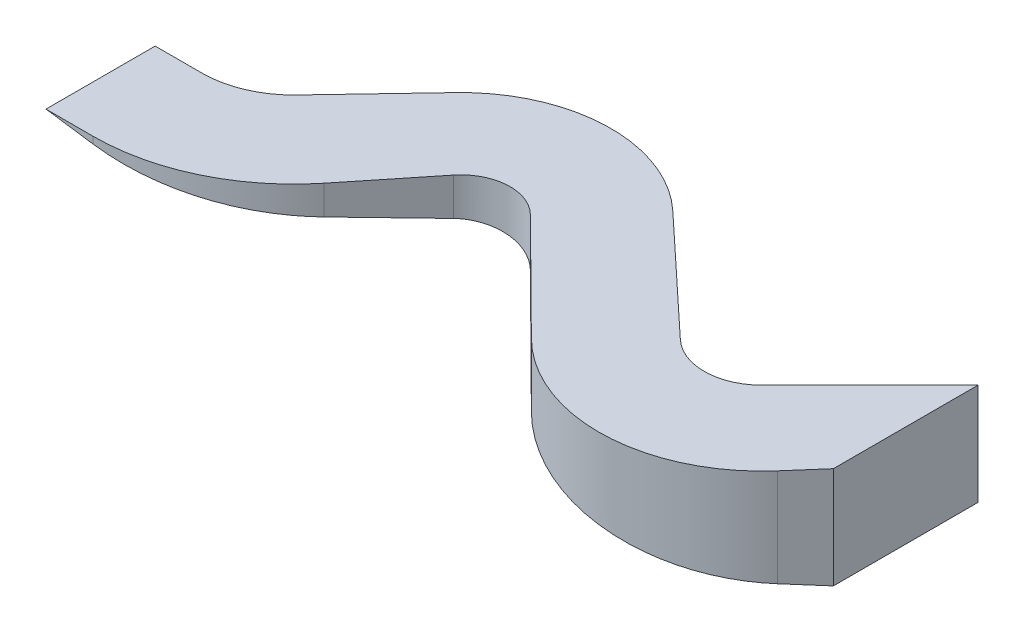
ISO-10303-21;
HEADER;
FILE_DESCRIPTION(('STEP AP214'),'2;1');
FILE_NAME('part.step','',(''),(''),'','','');
FILE_SCHEMA(('AUTOMOTIVE_DESIGN { 1 0 10303 214 1 1 1 1 }'));
ENDSEC;
DATA;
#1=APPLICATION_CONTEXT('core data for automotive mechanical design processes');
#2=APPLICATION_PROTOCOL_DEFINITION('international standard','automotive_design',2000,#1);
#3=PRODUCT_CONTEXT('',#1,'mechanical');
#4=PRODUCT('Part','Part','',(#3));
#5=PRODUCT_RELATED_PRODUCT_CATEGORY('part','',(#4));
#6=PRODUCT_DEFINITION_FORMATION('','',#4);
#7=PRODUCT_DEFINITION_CONTEXT('part definition',#1,'design');
#8=PRODUCT_DEFINITION('design','',#6,#7);
#9=PRODUCT_DEFINITION_SHAPE('','',#8);
#10=(LENGTH_UNIT() NAMED_UNIT(*) SI_UNIT(.MILLI.,.METRE.));
#11=(NAMED_UNIT(*) PLANE_ANGLE_UNIT() SI_UNIT($,.RADIAN.));
#12=(NAMED_UNIT(*) SI_UNIT($,.STERADIAN.) SOLID_ANGLE_UNIT());
#13=UNCERTAINTY_MEASURE_WITH_UNIT(LENGTH_MEASURE(1.E-05),#10,'distance_accuracy_value','');
#14=(GEOMETRIC_REPRESENTATION_CONTEXT(3) GLOBAL_UNCERTAINTY_ASSIGNED_CONTEXT((#13)) GLOBAL_UNIT_ASSIGNED_CONTEXT((#10,
#11,#12)) REPRESENTATION_CONTEXT('',''));
#15=CARTESIAN_POINT('',(0.,0.,0.));
#16=DIRECTION('',(0.,0.,1.));
#17=DIRECTION('',(1.,0.,0.));
#18=AXIS2_PLACEMENT_3D('',#15,#16,#17);
#19=CARTESIAN_POINT('',(0.,600.,0.));
#20=DIRECTION('',(0.707106781186548,0.,0.707106781186548));
#21=DIRECTION('',(0.707106781186548,0.,-0.707106781186548));
#22=AXIS2_PLACEMENT_3D('',#19,#20,#21);
#23=PLANE('',#22);
#24=DIRECTION('',(0.,-1.,0.));
#25=VECTOR('',#24,1.);
#26=CARTESIAN_POINT('',(0.,600.,0.));
#27=LINE('',#26,#25);
#28=CARTESIAN_POINT('',(0.,600.,0.));
#29=VERTEX_POINT('',#28);
#30=CARTESIAN_POINT('',(0.,0.,0.));
#31=VERTEX_POINT('',#30);
#32=EDGE_CURVE('E159',#29,#31,#27,.T.);
#33=ORIENTED_EDGE('',*,*,#32,.T.);
#34=DIRECTION('',(-0.703467177232089,0.101330455018382,0.703467177232089));
#35=VECTOR('',#34,1.);
#36=CARTESIAN_POINT('',(-42.7695894956545,6.16071666853935,42.7695894956545));
#37=LINE('',#36,#35);
#38=CARTESIAN_POINT('',(-638.381938967575,91.9552957760233,638.381938967575));
#39=VERTEX_POINT('',#38);
#40=EDGE_CURVE('E142',#31,#39,#37,.T.);
#41=ORIENTED_EDGE('',*,*,#40,.T.);
#42=DIRECTION('',(0.,-1.,0.));
#43=VECTOR('',#42,1.);
#44=CARTESIAN_POINT('',(-638.381938967575,600.,638.381938967575));
#45=LINE('',#44,#43);
#46=CARTESIAN_POINT('',(-638.381938967575,600.,638.381938967575));
#47=VERTEX_POINT('',#46);
#48=EDGE_CURVE('E11',#47,#39,#45,.T.);
#49=ORIENTED_EDGE('',*,*,#48,.F.);
#50=DIRECTION('',(-0.707106781186548,0.,0.707106781186548));
#51=VECTOR('',#50,1.);
#52=CARTESIAN_POINT('',(0.,600.,0.));
#53=LINE('',#52,#51);
#54=EDGE_CURVE('E146',#29,#47,#53,.T.);
#55=ORIENTED_EDGE('',*,*,#54,.F.);
#56=EDGE_LOOP('',(#33,#41,#49,#55));
#57=FACE_BOUND('',#56,.T.);
#58=ADVANCED_FACE('F34',(#57),#23,.F.);
#59=CARTESIAN_POINT('',(-879.381938967575,600.,397.381938967575));
#60=DIRECTION('',(0.,-1.,0.));
#61=DIRECTION('',(0.,0.,-1.));
#62=AXIS2_PLACEMENT_3D('',#59,#60,#61);
#63=CYLINDRICAL_SURFACE('',#62,340.825468531916);
#64=ORIENTED_EDGE('',*,*,#48,.T.);
#65=CARTESIAN_POINT('',(-879.381938967575,126.669978208709,397.381938967575));
#66=DIRECTION('',(0.142572814169557,0.989784316232467,0.));
#67=DIRECTION('',(0.989784316232467,-0.142572814169557,0.));
#68=AXIS2_PLACEMENT_3D('',#65,#66,#67);
#69=ELLIPSE('',#68,344.343169458615,340.825468531916);
#70=CARTESIAN_POINT('',(-1112.12672676416,160.195544168133,646.363592415223));
#71=VERTEX_POINT('',#70);
#72=EDGE_CURVE('E203',#39,#71,#69,.F.);
#73=ORIENTED_EDGE('',*,*,#72,.T.);
#74=DIRECTION('',(0.,-1.,0.));
#75=VECTOR('',#74,1.);
#76=CARTESIAN_POINT('',(-1112.12672676416,600.,646.363592415223));
#77=LINE('',#76,#75);
#78=CARTESIAN_POINT('',(-1112.12672676416,600.,646.363592415223));
#79=VERTEX_POINT('',#78);
#80=EDGE_CURVE('E42',#79,#71,#77,.T.);
#81=ORIENTED_EDGE('',*,*,#80,.F.);
#82=CARTESIAN_POINT('',(-879.381938967575,600.,397.381938967575));
#83=DIRECTION('',(0.,-1.,0.));
#84=DIRECTION('',(0.,0.,1.));
#85=AXIS2_PLACEMENT_3D('',#82,#83,#84);
#86=CIRCLE('',#85,340.825468531916);
#87=EDGE_CURVE('E202',#47,#79,#86,.T.);
#88=ORIENTED_EDGE('',*,*,#87,.F.);
#89=EDGE_LOOP('',(#64,#73,#81,#88));
#90=FACE_BOUND('',#89,.T.);
#91=ADVANCED_FACE('F201',(#90),#63,.F.);
#92=CARTESIAN_POINT('',(-1112.12672676416,600.,646.363592415223));
#93=DIRECTION('',(-0.682885550775046,0.,0.730525375700709));
#94=DIRECTION('',(0.730525375700709,0.,0.682885550775046));
#95=AXIS2_PLACEMENT_3D('',#92,#93,#94);
#96=PLANE('',#95);
#97=ORIENTED_EDGE('',*,*,#80,.T.);
#98=DIRECTION('',(-0.726514125789584,0.104650237176954,-0.679135886908507));
#99=VECTOR('',#98,1.);
#100=CARTESIAN_POINT('',(-1145.56500481895,165.012138374639,615.105928156107));
#101=LINE('',#100,#99);
#102=CARTESIAN_POINT('',(-1793.55142748472,258.350905526234,9.3767093559749));
#103=VERTEX_POINT('',#102);
#104=EDGE_CURVE('E197',#71,#103,#101,.T.);
#105=ORIENTED_EDGE('',*,*,#104,.T.);
#106=DIRECTION('',(0.,-1.,0.));
#107=VECTOR('',#106,1.);
#108=CARTESIAN_POINT('',(-1793.55142748472,600.,9.3767093559749));
#109=LINE('',#108,#107);
#110=CARTESIAN_POINT('',(-1793.55142748472,600.,9.3767093559749));
#111=VERTEX_POINT('',#110);
#112=EDGE_CURVE('E188',#111,#103,#109,.T.);
#113=ORIENTED_EDGE('',*,*,#112,.F.);
#114=DIRECTION('',(-0.730525375700709,0.,-0.682885550775046));
#115=VECTOR('',#114,1.);
#116=CARTESIAN_POINT('',(-1112.12672676416,600.,646.363592415223));
#117=LINE('',#116,#115);
#118=EDGE_CURVE('E198',#79,#111,#117,.T.);
#119=ORIENTED_EDGE('',*,*,#118,.F.);
#120=EDGE_LOOP('',(#97,#105,#113,#119));
#121=FACE_BOUND('',#120,.T.);
#122=ADVANCED_FACE('F195',(#121),#96,.F.);
#123=CARTESIAN_POINT('',(-2398.18055289071,600.,656.186293327256));
#124=DIRECTION('',(0.,-1.,0.));
#125=DIRECTION('',(0.,0.,-1.));
#126=AXIS2_PLACEMENT_3D('',#123,#124,#125);
#127=CYLINDRICAL_SURFACE('',#126,885.403307654947);
#128=ORIENTED_EDGE('',*,*,#112,.T.);
#129=CARTESIAN_POINT('',(-2398.18055289071,345.444300040847,656.186293327256));
#130=DIRECTION('',(0.142572814169557,0.989784316232467,0.));
#131=DIRECTION('',(0.989784316232467,-0.142572814169557,0.));
#132=AXIS2_PLACEMENT_3D('',#129,#130,#131);
#133=ELLIPSE('',#132,894.541662394856,885.403307654947);
#134=CARTESIAN_POINT('',(-3040.46336347203,437.961494237127,46.7506458319029));
#135=VERTEX_POINT('',#134);
#136=EDGE_CURVE('E207',#103,#135,#133,.T.);
#137=ORIENTED_EDGE('',*,*,#136,.T.);
#138=DIRECTION('',(0.,-1.,0.));
#139=VECTOR('',#138,1.);
#140=CARTESIAN_POINT('',(-3040.46336347203,600.,46.7506458319029));
#141=LINE('',#140,#139);
#142=CARTESIAN_POINT('',(-3040.46336347203,600.,46.7506458319029));
#143=VERTEX_POINT('',#142);
#144=EDGE_CURVE('E185',#143,#135,#141,.T.);
#145=ORIENTED_EDGE('',*,*,#144,.F.);
#146=CARTESIAN_POINT('',(-2398.18055289071,600.,656.186293327256));
#147=DIRECTION('',(0.,1.,0.));
#148=DIRECTION('',(0.,0.,1.));
#149=AXIS2_PLACEMENT_3D('',#146,#147,#148);
#150=CIRCLE('',#149,885.403307654947);
#151=EDGE_CURVE('E214',#111,#143,#150,.T.);
#152=ORIENTED_EDGE('',*,*,#151,.F.);
#153=EDGE_LOOP('',(#128,#137,#145,#152));
#154=FACE_BOUND('',#153,.T.);
#155=ADVANCED_FACE('F274',(#154),#127,.T.);
#156=CARTESIAN_POINT('',(-3496.49394462519,600.,527.360214008368));
#157=DIRECTION('',(0.725412707438887,0.,0.68831417527622));
#158=DIRECTION('',(0.68831417527622,0.,-0.725412707438887));
#159=AXIS2_PLACEMENT_3D('',#156,#157,#158);
#160=PLANE('',#159);
#161=ORIENTED_EDGE('',*,*,#144,.T.);
#162=DIRECTION('',(-0.684955756385808,0.0986639898895165,0.721873277586189));
#163=VECTOR('',#162,1.);
#164=CARTESIAN_POINT('',(-3503.00531515237,504.588037657781,534.222532253319));
#165=LINE('',#164,#163);
#166=CARTESIAN_POINT('',(-3496.49394462519,503.65011168246,527.360214008368));
#167=VERTEX_POINT('',#166);
#168=EDGE_CURVE('E269',#135,#167,#165,.T.);
#169=ORIENTED_EDGE('',*,*,#168,.T.);
#170=DIRECTION('',(0.,-1.,0.));
#171=VECTOR('',#170,1.);
#172=CARTESIAN_POINT('',(-3496.49394462519,600.,527.360214008368));
#173=LINE('',#172,#171);
#174=CARTESIAN_POINT('',(-3496.49394462519,600.,527.360214008368));
#175=VERTEX_POINT('',#174);
#176=EDGE_CURVE('E182',#175,#167,#173,.T.);
#177=ORIENTED_EDGE('',*,*,#176,.F.);
#178=DIRECTION('',(-0.68831417527622,0.,0.725412707438887));
#179=VECTOR('',#178,1.);
#180=CARTESIAN_POINT('',(-3496.49394462519,600.,527.360214008368));
#181=LINE('',#180,#179);
#182=EDGE_CURVE('E216',#143,#175,#181,.T.);
#183=ORIENTED_EDGE('',*,*,#182,.F.);
#184=EDGE_LOOP('',(#161,#169,#177,#183));
#185=FACE_BOUND('',#184,.T.);
#186=ADVANCED_FACE('F278',(#185),#160,.F.);
#187=CARTESIAN_POINT('',(-3888.21680664219,600.,155.670559359209));
#188=DIRECTION('',(0.,-1.,0.));
#189=DIRECTION('',(0.,0.,-1.));
#190=AXIS2_PLACEMENT_3D('',#187,#188,#189);
#191=CYLINDRICAL_SURFACE('',#190,540.);
#192=ORIENTED_EDGE('',*,*,#176,.T.);
#193=CARTESIAN_POINT('',(-3888.21680664219,560.0755671038,155.670559359209));
#194=DIRECTION('',(0.142572814169557,0.989784316232467,0.));
#195=DIRECTION('',(0.989784316232467,-0.142572814169557,0.));
#196=AXIS2_PLACEMENT_3D('',#193,#194,#195);
#197=ELLIPSE('',#196,545.573405381351,540.);
#198=CARTESIAN_POINT('',(-3888.21680664219,560.0755671038,695.670559359209));
#199=VERTEX_POINT('',#198);
#200=EDGE_CURVE('E266',#167,#199,#197,.F.);
#201=ORIENTED_EDGE('',*,*,#200,.T.);
#202=DIRECTION('',(0.,-1.,0.));
#203=VECTOR('',#202,1.);
#204=CARTESIAN_POINT('',(-3888.21680664219,600.,695.670559359209));
#205=LINE('',#204,#203);
#206=CARTESIAN_POINT('',(-3888.21680664219,600.,695.670559359209));
#207=VERTEX_POINT('',#206);
#208=EDGE_CURVE('E179',#207,#199,#205,.T.);
#209=ORIENTED_EDGE('',*,*,#208,.F.);
#210=CARTESIAN_POINT('',(-3888.21680664219,600.,155.670559359209));
#211=DIRECTION('',(0.,-1.,0.));
#212=DIRECTION('',(0.,0.,1.));
#213=AXIS2_PLACEMENT_3D('',#210,#211,#212);
#214=CIRCLE('',#213,540.);
#215=EDGE_CURVE('E218',#175,#207,#214,.T.);
#216=ORIENTED_EDGE('',*,*,#215,.F.);
#217=EDGE_LOOP('',(#192,#201,#209,#216));
#218=FACE_BOUND('',#217,.T.);
#219=ADVANCED_FACE('F297',(#218),#191,.F.);
#220=CARTESIAN_POINT('',(-3888.21680664219,600.,695.670559359209));
#221=DIRECTION('',(0.,0.,1.));
#222=DIRECTION('',(1.,0.,0.));
#223=AXIS2_PLACEMENT_3D('',#220,#221,#222);
#224=PLANE('',#223);
#225=ORIENTED_EDGE('',*,*,#208,.T.);
#226=DIRECTION('',(-0.989784316232467,0.142572814169557,0.));
#227=VECTOR('',#226,1.);
#228=CARTESIAN_POINT('',(-3893.85079630487,560.887111344335,695.670559359209));
#229=LINE('',#228,#227);
#230=CARTESIAN_POINT('',(-4165.38449632628,600.,695.670559359209));
#231=VERTEX_POINT('',#230);
#232=EDGE_CURVE('E263',#199,#231,#229,.T.);
#233=ORIENTED_EDGE('',*,*,#232,.T.);
#234=DIRECTION('',(-1.,0.,0.));
#235=VECTOR('',#234,1.);
#236=CARTESIAN_POINT('',(-3888.21680664219,600.,695.670559359209));
#237=LINE('',#236,#235);
#238=EDGE_CURVE('E220',#207,#231,#237,.T.);
#239=ORIENTED_EDGE('',*,*,#238,.F.);
#240=EDGE_LOOP('',(#225,#233,#239));
#241=FACE_BOUND('',#240,.T.);
#242=ADVANCED_FACE('F300',(#241),#224,.F.);
#243=CARTESIAN_POINT('',(-3888.21680664219,600.,1340.51225072757));
#244=DIRECTION('',(0.,0.,-1.));
#245=DIRECTION('',(-1.,0.,0.));
#246=AXIS2_PLACEMENT_3D('',#243,#244,#245);
#247=PLANE('',#246);
#248=DIRECTION('',(1.,0.,0.));
#249=VECTOR('',#248,1.);
#250=CARTESIAN_POINT('',(-3888.21680664219,600.,1340.51225072757));
#251=LINE('',#250,#249);
#252=CARTESIAN_POINT('',(-4165.38449632628,600.,1340.51225072757));
#253=VERTEX_POINT('',#252);
#254=CARTESIAN_POINT('',(-3888.21680664219,600.,1340.51225072757));
#255=VERTEX_POINT('',#254);
#256=EDGE_CURVE('E226',#253,#255,#251,.T.);
#257=ORIENTED_EDGE('',*,*,#256,.F.);
#258=DIRECTION('',(0.989784316232467,-0.142572814169557,0.));
#259=VECTOR('',#258,1.);
#260=CARTESIAN_POINT('',(-3893.85079630487,560.887111344335,1340.51225072757));
#261=LINE('',#260,#259);
#262=CARTESIAN_POINT('',(-3888.21680664219,560.0755671038,1340.51225072757));
#263=VERTEX_POINT('',#262);
#264=EDGE_CURVE('E260',#253,#263,#261,.T.);
#265=ORIENTED_EDGE('',*,*,#264,.T.);
#266=DIRECTION('',(0.,-1.,0.));
#267=VECTOR('',#266,1.);
#268=CARTESIAN_POINT('',(-3888.21680664219,600.,1340.51225072757));
#269=LINE('',#268,#267);
#270=EDGE_CURVE('E176',#255,#263,#269,.T.);
#271=ORIENTED_EDGE('',*,*,#270,.F.);
#272=EDGE_LOOP('',(#257,#265,#271));
#273=FACE_BOUND('',#272,.T.);
#274=ADVANCED_FACE('F304',(#273),#247,.F.);
#275=CARTESIAN_POINT('',(-3888.21680664219,600.,155.670559359209));
#276=DIRECTION('',(0.,-1.,0.));
#277=DIRECTION('',(0.,0.,-1.));
#278=AXIS2_PLACEMENT_3D('',#275,#276,#277);
#279=CYLINDRICAL_SURFACE('',#278,1184.84169136836);
#280=ORIENTED_EDGE('',*,*,#270,.T.);
#281=CARTESIAN_POINT('',(-3888.21680664219,560.0755671038,155.670559359209));
#282=DIRECTION('',(0.142572814169557,0.989784316232467,0.));
#283=DIRECTION('',(0.989784316232467,-0.142572814169557,0.));
#284=AXIS2_PLACEMENT_3D('',#281,#282,#283);
#285=ELLIPSE('',#284,1197.07058592155,1184.84169136836);
#286=CARTESIAN_POINT('',(-2964.85910631376,427.071130013856,898.139677133703));
#287=VERTEX_POINT('',#286);
#288=EDGE_CURVE('E257',#263,#287,#285,.T.);
#289=ORIENTED_EDGE('',*,*,#288,.T.);
#290=DIRECTION('',(0.,-1.,0.));
#291=VECTOR('',#290,1.);
#292=CARTESIAN_POINT('',(-2964.85910631376,600.,898.139677133703));
#293=LINE('',#292,#291);
#294=CARTESIAN_POINT('',(-2964.85910631376,600.,898.139677133703));
#295=VERTEX_POINT('',#294);
#296=EDGE_CURVE('E173',#295,#287,#293,.T.);
#297=ORIENTED_EDGE('',*,*,#296,.F.);
#298=CARTESIAN_POINT('',(-3888.21680664219,600.,155.670559359209));
#299=DIRECTION('',(0.,1.,0.));
#300=DIRECTION('',(0.,0.,1.));
#301=AXIS2_PLACEMENT_3D('',#298,#299,#300);
#302=CIRCLE('',#301,1184.84169136836);
#303=EDGE_CURVE('E228',#255,#295,#302,.T.);
#304=ORIENTED_EDGE('',*,*,#303,.F.);
#305=EDGE_LOOP('',(#280,#289,#297,#304));
#306=FACE_BOUND('',#305,.T.);
#307=ADVANCED_FACE('F308',(#306),#279,.T.);
#308=CARTESIAN_POINT('',(-2624.18014004737,600.,474.460712835623));
#309=DIRECTION('',(-0.77930892122985,0.,-0.626639932729767));
#310=DIRECTION('',(-0.626639932729767,0.,0.77930892122985));
#311=AXIS2_PLACEMENT_3D('',#308,#309,#310);
#312=PLANE('',#311);
#313=ORIENTED_EDGE('',*,*,#296,.T.);
#314=DIRECTION('',(0.624102628538225,-0.0898984421373818,-0.776153450776939));
#315=VECTOR('',#314,1.);
#316=CARTESIAN_POINT('',(-2636.63573737356,379.792416238978,489.950881285727));
#317=LINE('',#316,#315);
#318=CARTESIAN_POINT('',(-2624.18014004737,377.99825812409,474.460712835623));
#319=VERTEX_POINT('',#318);
#320=EDGE_CURVE('E254',#287,#319,#317,.T.);
#321=ORIENTED_EDGE('',*,*,#320,.T.);
#322=DIRECTION('',(0.,-1.,0.));
#323=VECTOR('',#322,1.);
#324=CARTESIAN_POINT('',(-2624.18014004737,600.,474.460712835623));
#325=LINE('',#324,#323);
#326=CARTESIAN_POINT('',(-2624.18014004737,600.,474.460712835623));
#327=VERTEX_POINT('',#326);
#328=EDGE_CURVE('E170',#327,#319,#325,.T.);
#329=ORIENTED_EDGE('',*,*,#328,.F.);
#330=DIRECTION('',(0.626639932729767,0.,-0.77930892122985));
#331=VECTOR('',#330,1.);
#332=CARTESIAN_POINT('',(-2624.18014004737,600.,474.460712835623));
#333=LINE('',#332,#331);
#334=EDGE_CURVE('E230',#295,#327,#333,.T.);
#335=ORIENTED_EDGE('',*,*,#334,.F.);
#336=EDGE_LOOP('',(#313,#321,#329,#335));
#337=FACE_BOUND('',#336,.T.);
#338=ADVANCED_FACE('F312',(#337),#312,.F.);
#339=CARTESIAN_POINT('',(-2398.18055289071,600.,656.186293327256));
#340=DIRECTION('',(0.,-1.,0.));
#341=DIRECTION('',(0.,0.,-1.));
#342=AXIS2_PLACEMENT_3D('',#339,#340,#341);
#343=CYLINDRICAL_SURFACE('',#342,290.);
#344=ORIENTED_EDGE('',*,*,#328,.T.);
#345=CARTESIAN_POINT('',(-2398.18055289071,345.444300040847,656.186293327256));
#346=DIRECTION('',(0.142572814169557,0.989784316232467,0.));
#347=DIRECTION('',(0.989784316232467,-0.142572814169557,0.));
#348=AXIS2_PLACEMENT_3D('',#345,#346,#347);
#349=ELLIPSE('',#348,292.993125112207,290.);
#350=CARTESIAN_POINT('',(-2194.05148826295,316.04066662245,450.197640789799));
#351=VERTEX_POINT('',#350);
#352=EDGE_CURVE('E249',#319,#351,#349,.F.);
#353=ORIENTED_EDGE('',*,*,#352,.T.);
#354=DIRECTION('',(0.,-1.,0.));
#355=VECTOR('',#354,1.);
#356=CARTESIAN_POINT('',(-2194.05148826295,600.,450.197640789799));
#357=LINE('',#356,#355);
#358=CARTESIAN_POINT('',(-2194.05148826295,600.,450.197640789799));
#359=VERTEX_POINT('',#358);
#360=EDGE_CURVE('E167',#359,#351,#357,.T.);
#361=ORIENTED_EDGE('',*,*,#360,.F.);
#362=CARTESIAN_POINT('',(-2398.18055289071,600.,656.186293327256));
#363=DIRECTION('',(0.,-1.,0.));
#364=DIRECTION('',(0.,0.,1.));
#365=AXIS2_PLACEMENT_3D('',#362,#363,#364);
#366=CIRCLE('',#365,290.);
#367=EDGE_CURVE('E232',#327,#359,#366,.T.);
#368=ORIENTED_EDGE('',*,*,#367,.F.);
#369=EDGE_LOOP('',(#344,#353,#361,#368));
#370=FACE_BOUND('',#369,.T.);
#371=ADVANCED_FACE('F316',(#370),#343,.F.);
#372=CARTESIAN_POINT('',(-2194.05148826295,600.,450.197640789799));
#373=DIRECTION('',(0.703893326302611,0.,-0.710305698405022));
#374=DIRECTION('',(-0.710305698405022,0.,-0.703893326302611));
#375=AXIS2_PLACEMENT_3D('',#372,#373,#374);
#376=PLANE('',#375);
#377=ORIENTED_EDGE('',*,*,#360,.T.);
#378=DIRECTION('',(0.706616732302552,-0.101784130553964,0.700237662795594));
#379=VECTOR('',#378,1.);
#380=CARTESIAN_POINT('',(-2214.47451642707,318.982487937931,429.958984025687));
#381=LINE('',#380,#379);
#382=CARTESIAN_POINT('',(-1557.16252347899,224.300425305613,1081.33701206877));
#383=VERTEX_POINT('',#382);
#384=EDGE_CURVE('E247',#351,#383,#381,.T.);
#385=ORIENTED_EDGE('',*,*,#384,.T.);
#386=DIRECTION('',(0.,-1.,0.));
#387=VECTOR('',#386,1.);
#388=CARTESIAN_POINT('',(-1557.16252347899,600.,1081.33701206877));
#389=LINE('',#388,#387);
#390=CARTESIAN_POINT('',(-1557.16252347899,600.,1081.33701206877));
#391=VERTEX_POINT('',#390);
#392=EDGE_CURVE('E161',#391,#383,#389,.T.);
#393=ORIENTED_EDGE('',*,*,#392,.F.);
#394=DIRECTION('',(0.710305698405022,0.,0.703893326302611));
#395=VECTOR('',#394,1.);
#396=CARTESIAN_POINT('',(-2194.05148826295,600.,450.197640789799));
#397=LINE('',#396,#395);
#398=EDGE_CURVE('E234',#359,#391,#397,.T.);
#399=ORIENTED_EDGE('',*,*,#398,.F.);
#400=EDGE_LOOP('',(#377,#385,#393,#399));
#401=FACE_BOUND('',#400,.T.);
#402=ADVANCED_FACE('F320',(#401),#376,.F.);
#403=CARTESIAN_POINT('',(-879.381938967575,600.,397.381938967575));
#404=DIRECTION('',(0.,-1.,0.));
#405=DIRECTION('',(0.,0.,-1.));
#406=AXIS2_PLACEMENT_3D('',#403,#404,#405);
#407=CYLINDRICAL_SURFACE('',#406,962.902416011865);
#408=ORIENTED_EDGE('',*,*,#392,.T.);
#409=CARTESIAN_POINT('',(-879.381938967575,126.669978208709,397.381938967575));
#410=DIRECTION('',(0.142572814169557,0.989784316232467,0.));
#411=DIRECTION('',(0.989784316232467,-0.142572814169557,0.));
#412=AXIS2_PLACEMENT_3D('',#409,#410,#411);
#413=ELLIPSE('',#412,972.840648432453,962.902416011865);
#414=CARTESIAN_POINT('',(-154.190463005445,22.2102612339536,1030.84731762165));
#415=VERTEX_POINT('',#414);
#416=EDGE_CURVE('E156',#383,#415,#413,.T.);
#417=ORIENTED_EDGE('',*,*,#416,.T.);
#418=DIRECTION('',(0.,-1.,0.));
#419=VECTOR('',#418,1.);
#420=CARTESIAN_POINT('',(-154.190463005445,600.,1030.84731762165));
#421=LINE('',#420,#419);
#422=CARTESIAN_POINT('',(-154.190463005445,600.,1030.84731762165));
#423=VERTEX_POINT('',#422);
#424=EDGE_CURVE('E155',#423,#415,#421,.T.);
#425=ORIENTED_EDGE('',*,*,#424,.F.);
#426=CARTESIAN_POINT('',(-879.381938967575,600.,397.381938967575));
#427=DIRECTION('',(0.,1.,0.));
#428=DIRECTION('',(0.,0.,1.));
#429=AXIS2_PLACEMENT_3D('',#426,#427,#428);
#430=CIRCLE('',#429,962.902416011865);
#431=EDGE_CURVE('E236',#391,#423,#430,.T.);
#432=ORIENTED_EDGE('',*,*,#431,.F.);
#433=EDGE_LOOP('',(#408,#417,#425,#432));
#434=FACE_BOUND('',#433,.T.);
#435=ADVANCED_FACE('F245',(#434),#407,.T.);
#436=CARTESIAN_POINT('',(1.04625249991556E-13,600.,854.33));
#437=DIRECTION('',(-0.753130809418588,0.,-0.657870795752861));
#438=DIRECTION('',(-0.657870795752861,0.,0.753130809418588));
#439=AXIS2_PLACEMENT_3D('',#436,#437,#438);
#440=PLANE('',#439);
#441=ORIENTED_EDGE('',*,*,#424,.T.);
#442=DIRECTION('',(0.654936721156535,-0.0943399182093513,-0.749771879382643));
#443=VECTOR('',#442,1.);
#444=CARTESIAN_POINT('',(-37.0720060237248,5.34001210064827,896.770050665978));
#445=LINE('',#444,#443);
#446=CARTESIAN_POINT('',(1.04625249991556E-13,0.,854.33));
#447=VERTEX_POINT('',#446);
#448=EDGE_CURVE('E139',#415,#447,#445,.T.);
#449=ORIENTED_EDGE('',*,*,#448,.T.);
#450=DIRECTION('',(0.,-1.,0.));
#451=VECTOR('',#450,1.);
#452=CARTESIAN_POINT('',(1.04625249991556E-13,600.,854.33));
#453=LINE('',#452,#451);
#454=CARTESIAN_POINT('',(1.04625249991556E-13,600.,854.33));
#455=VERTEX_POINT('',#454);
#456=EDGE_CURVE('E153',#455,#447,#453,.T.);
#457=ORIENTED_EDGE('',*,*,#456,.F.);
#458=DIRECTION('',(0.657870795752861,0.,-0.753130809418588));
#459=VECTOR('',#458,1.);
#460=CARTESIAN_POINT('',(1.04625249991556E-13,600.,854.33));
#461=LINE('',#460,#459);
#462=EDGE_CURVE('E238',#423,#455,#461,.T.);
#463=ORIENTED_EDGE('',*,*,#462,.F.);
#464=EDGE_LOOP('',(#441,#449,#457,#463));
#465=FACE_BOUND('',#464,.T.);
#466=ADVANCED_FACE('F151',(#465),#440,.F.);
#467=CARTESIAN_POINT('',(0.,600.,0.));
#468=DIRECTION('',(-1.,0.,0.));
#469=DIRECTION('',(0.,0.,1.));
#470=AXIS2_PLACEMENT_3D('',#467,#468,#469);
#471=PLANE('',#470);
#472=DIRECTION('',(0.,0.,-1.));
#473=VECTOR('',#472,1.);
#474=CARTESIAN_POINT('',(0.,0.,0.));
#475=LINE('',#474,#473);
#476=EDGE_CURVE('E136',#447,#31,#475,.T.);
#477=ORIENTED_EDGE('',*,*,#476,.T.);
#478=ORIENTED_EDGE('',*,*,#32,.F.);
#479=DIRECTION('',(0.,0.,-1.));
#480=VECTOR('',#479,1.);
#481=CARTESIAN_POINT('',(0.,600.,0.));
#482=LINE('',#481,#480);
#483=EDGE_CURVE('E49',#455,#29,#482,.T.);
#484=ORIENTED_EDGE('',*,*,#483,.F.);
#485=ORIENTED_EDGE('',*,*,#456,.T.);
#486=EDGE_LOOP('',(#477,#478,#484,#485));
#487=FACE_BOUND('',#486,.T.);
#488=ADVANCED_FACE('F158',(#487),#471,.F.);
#489=CARTESIAN_POINT('',(-879.381938967575,600.,397.381938967575));
#490=DIRECTION('',(0.,1.,0.));
#491=DIRECTION('',(0.,0.,1.));
#492=AXIS2_PLACEMENT_3D('',#489,#490,#491);
#493=PLANE('',#492);
#494=ORIENTED_EDGE('',*,*,#54,.T.);
#495=ORIENTED_EDGE('',*,*,#87,.T.);
#496=ORIENTED_EDGE('',*,*,#118,.T.);
#497=ORIENTED_EDGE('',*,*,#151,.T.);
#498=ORIENTED_EDGE('',*,*,#182,.T.);
#499=ORIENTED_EDGE('',*,*,#215,.T.);
#500=ORIENTED_EDGE('',*,*,#238,.T.);
#501=DIRECTION('',(0.,0.,1.));
#502=VECTOR('',#501,1.);
#503=CARTESIAN_POINT('',(-4165.38449632628,600.,695.670559359209));
#504=LINE('',#503,#502);
#505=EDGE_CURVE('E223',#231,#253,#504,.T.);
#506=ORIENTED_EDGE('',*,*,#505,.T.);
#507=ORIENTED_EDGE('',*,*,#256,.T.);
#508=ORIENTED_EDGE('',*,*,#303,.T.);
#509=ORIENTED_EDGE('',*,*,#334,.T.);
#510=ORIENTED_EDGE('',*,*,#367,.T.);
#511=ORIENTED_EDGE('',*,*,#398,.T.);
#512=ORIENTED_EDGE('',*,*,#431,.T.);
#513=ORIENTED_EDGE('',*,*,#462,.T.);
#514=ORIENTED_EDGE('',*,*,#483,.T.);
#515=EDGE_LOOP('',(#494,#495,#496,#497,#498,#499,#500,#506,#507,#508,#509,#510,#511,#512,#513,#514));
#516=FACE_BOUND('',#515,.T.);
#517=ADVANCED_FACE('F240',(#516),#493,.T.);
#518=CARTESIAN_POINT('',(-4165.38449632628,600.,2000.));
#519=DIRECTION('',(0.142572814169557,0.989784316232467,0.));
#520=DIRECTION('',(-0.989784316232467,0.142572814169557,0.));
#521=AXIS2_PLACEMENT_3D('',#518,#519,#520);
#522=PLANE('',#521);
#523=ORIENTED_EDGE('',*,*,#476,.F.);
#524=ORIENTED_EDGE('',*,*,#448,.F.);
#525=ORIENTED_EDGE('',*,*,#416,.F.);
#526=ORIENTED_EDGE('',*,*,#384,.F.);
#527=ORIENTED_EDGE('',*,*,#352,.F.);
#528=ORIENTED_EDGE('',*,*,#320,.F.);
#529=ORIENTED_EDGE('',*,*,#288,.F.);
#530=ORIENTED_EDGE('',*,*,#264,.F.);
#531=ORIENTED_EDGE('',*,*,#505,.F.);
#532=ORIENTED_EDGE('',*,*,#232,.F.);
#533=ORIENTED_EDGE('',*,*,#200,.F.);
#534=ORIENTED_EDGE('',*,*,#168,.F.);
#535=ORIENTED_EDGE('',*,*,#136,.F.);
#536=ORIENTED_EDGE('',*,*,#104,.F.);
#537=ORIENTED_EDGE('',*,*,#72,.F.);
#538=ORIENTED_EDGE('',*,*,#40,.F.);
#539=EDGE_LOOP('',(#523,#524,#525,#526,#527,#528,#529,#530,#531,#532,#533,#534,#535,#536,#537,#538));
#540=FACE_BOUND('',#539,.T.);
#541=ADVANCED_FACE('F138',(#540),#522,.F.);
#542=CLOSED_SHELL('',(#58,#91,#122,#155,#186,#219,#242,#274,#307,#338,#371,#402,#435,#466,#488,
#517,#541));
#543=MANIFOLD_SOLID_BREP('B2',#542);
#544=ADVANCED_BREP_SHAPE_REPRESENTATION('',(#18,#543),#14);
#545=SHAPE_DEFINITION_REPRESENTATION(#9,#544);
ENDSEC;
END-ISO-10303-21;
